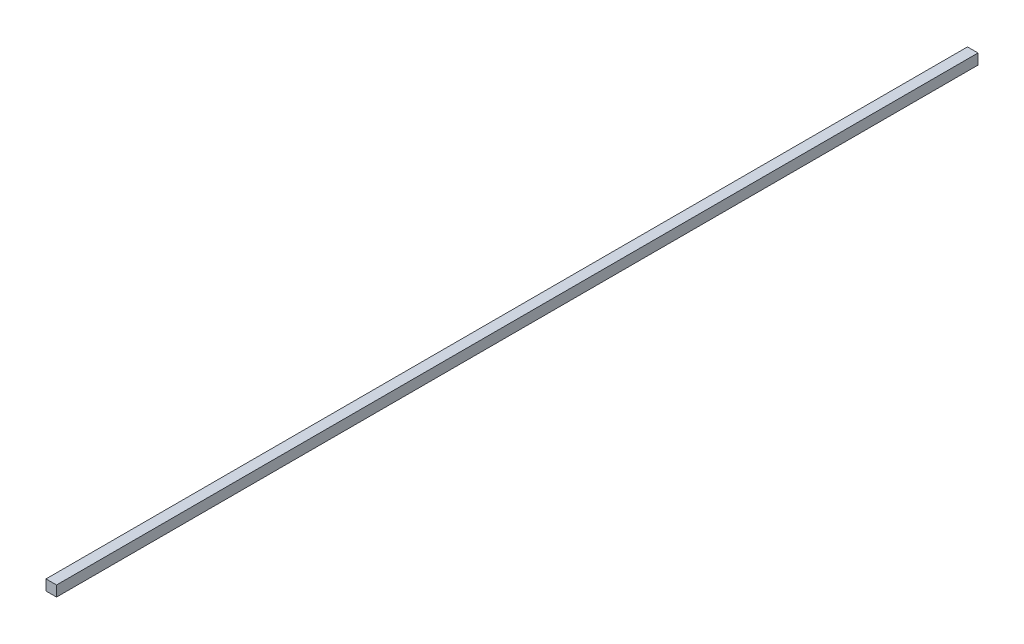
ISO-10303-21;
HEADER;
FILE_DESCRIPTION(('STEP AP214'),'2;1');
FILE_NAME('part.step','',(''),(''),'','','');
FILE_SCHEMA(('AUTOMOTIVE_DESIGN { 1 0 10303 214 1 1 1 1 }'));
ENDSEC;
DATA;
#1=APPLICATION_CONTEXT('core data for automotive mechanical design processes');
#2=APPLICATION_PROTOCOL_DEFINITION('international standard','automotive_design',2000,#1);
#3=PRODUCT_CONTEXT('',#1,'mechanical');
#4=PRODUCT('Part','Part','',(#3));
#5=PRODUCT_RELATED_PRODUCT_CATEGORY('part','',(#4));
#6=PRODUCT_DEFINITION_FORMATION('','',#4);
#7=PRODUCT_DEFINITION_CONTEXT('part definition',#1,'design');
#8=PRODUCT_DEFINITION('design','',#6,#7);
#9=PRODUCT_DEFINITION_SHAPE('','',#8);
#10=(LENGTH_UNIT() NAMED_UNIT(*) SI_UNIT(.MILLI.,.METRE.));
#11=(NAMED_UNIT(*) PLANE_ANGLE_UNIT() SI_UNIT($,.RADIAN.));
#12=(NAMED_UNIT(*) SI_UNIT($,.STERADIAN.) SOLID_ANGLE_UNIT());
#13=UNCERTAINTY_MEASURE_WITH_UNIT(LENGTH_MEASURE(1.E-05),#10,'distance_accuracy_value','');
#14=(GEOMETRIC_REPRESENTATION_CONTEXT(3) GLOBAL_UNCERTAINTY_ASSIGNED_CONTEXT((#13)) GLOBAL_UNIT_ASSIGNED_CONTEXT((#10,
#11,#12)) REPRESENTATION_CONTEXT('',''));
#15=CARTESIAN_POINT('',(0.,0.,0.));
#16=DIRECTION('',(0.,0.,1.));
#17=DIRECTION('',(1.,0.,0.));
#18=AXIS2_PLACEMENT_3D('',#15,#16,#17);
#19=CARTESIAN_POINT('',(-2.,-2.,175.));
#20=DIRECTION('',(1.,0.,0.));
#21=DIRECTION('',(0.,0.,-1.));
#22=AXIS2_PLACEMENT_3D('',#19,#20,#21);
#23=PLANE('',#22);
#24=DIRECTION('',(0.,0.,-1.));
#25=VECTOR('',#24,1.);
#26=CARTESIAN_POINT('',(-2.,2.,175.));
#27=LINE('',#26,#25);
#28=CARTESIAN_POINT('',(-2.,2.,175.));
#29=VERTEX_POINT('',#28);
#30=CARTESIAN_POINT('',(-2.,2.,-175.));
#31=VERTEX_POINT('',#30);
#32=EDGE_CURVE('E94',#29,#31,#27,.T.);
#33=ORIENTED_EDGE('',*,*,#32,.T.);
#34=DIRECTION('',(0.,-1.,0.));
#35=VECTOR('',#34,1.);
#36=CARTESIAN_POINT('',(-2.,-2.,-175.));
#37=LINE('',#36,#35);
#38=CARTESIAN_POINT('',(-2.,-2.,-175.));
#39=VERTEX_POINT('',#38);
#40=EDGE_CURVE('E89',#31,#39,#37,.T.);
#41=ORIENTED_EDGE('',*,*,#40,.T.);
#42=DIRECTION('',(0.,0.,-1.));
#43=VECTOR('',#42,1.);
#44=CARTESIAN_POINT('',(-2.,-2.,175.));
#45=LINE('',#44,#43);
#46=CARTESIAN_POINT('',(-2.,-2.,175.));
#47=VERTEX_POINT('',#46);
#48=EDGE_CURVE('E11',#47,#39,#45,.T.);
#49=ORIENTED_EDGE('',*,*,#48,.F.);
#50=DIRECTION('',(0.,-1.,0.));
#51=VECTOR('',#50,1.);
#52=CARTESIAN_POINT('',(-2.,-2.,175.));
#53=LINE('',#52,#51);
#54=EDGE_CURVE('E100',#29,#47,#53,.T.);
#55=ORIENTED_EDGE('',*,*,#54,.F.);
#56=EDGE_LOOP('',(#33,#41,#49,#55));
#57=FACE_BOUND('',#56,.T.);
#58=ADVANCED_FACE('F37',(#57),#23,.F.);
#59=CARTESIAN_POINT('',(2.,-2.,175.));
#60=DIRECTION('',(0.,1.,0.));
#61=DIRECTION('',(0.,0.,1.));
#62=AXIS2_PLACEMENT_3D('',#59,#60,#61);
#63=PLANE('',#62);
#64=ORIENTED_EDGE('',*,*,#48,.T.);
#65=DIRECTION('',(1.,0.,0.));
#66=VECTOR('',#65,1.);
#67=CARTESIAN_POINT('',(2.,-2.,-175.));
#68=LINE('',#67,#66);
#69=CARTESIAN_POINT('',(2.,-2.,-175.));
#70=VERTEX_POINT('',#69);
#71=EDGE_CURVE('E79',#39,#70,#68,.T.);
#72=ORIENTED_EDGE('',*,*,#71,.T.);
#73=DIRECTION('',(0.,0.,-1.));
#74=VECTOR('',#73,1.);
#75=CARTESIAN_POINT('',(2.,-2.,175.));
#76=LINE('',#75,#74);
#77=CARTESIAN_POINT('',(2.,-2.,175.));
#78=VERTEX_POINT('',#77);
#79=EDGE_CURVE('E44',#78,#70,#76,.T.);
#80=ORIENTED_EDGE('',*,*,#79,.F.);
#81=DIRECTION('',(1.,0.,0.));
#82=VECTOR('',#81,1.);
#83=CARTESIAN_POINT('',(2.,-2.,175.));
#84=LINE('',#83,#82);
#85=EDGE_CURVE('E80',#47,#78,#84,.T.);
#86=ORIENTED_EDGE('',*,*,#85,.F.);
#87=EDGE_LOOP('',(#64,#72,#80,#86));
#88=FACE_BOUND('',#87,.T.);
#89=ADVANCED_FACE('F77',(#88),#63,.F.);
#90=CARTESIAN_POINT('',(2.,2.,175.));
#91=DIRECTION('',(-1.,0.,0.));
#92=DIRECTION('',(0.,0.,1.));
#93=AXIS2_PLACEMENT_3D('',#90,#91,#92);
#94=PLANE('',#93);
#95=ORIENTED_EDGE('',*,*,#79,.T.);
#96=DIRECTION('',(0.,1.,0.));
#97=VECTOR('',#96,1.);
#98=CARTESIAN_POINT('',(2.,2.,-175.));
#99=LINE('',#98,#97);
#100=CARTESIAN_POINT('',(2.,2.,-175.));
#101=VERTEX_POINT('',#100);
#102=EDGE_CURVE('E92',#70,#101,#99,.T.);
#103=ORIENTED_EDGE('',*,*,#102,.T.);
#104=DIRECTION('',(0.,0.,-1.));
#105=VECTOR('',#104,1.);
#106=CARTESIAN_POINT('',(2.,2.,175.));
#107=LINE('',#106,#105);
#108=CARTESIAN_POINT('',(2.,2.,175.));
#109=VERTEX_POINT('',#108);
#110=EDGE_CURVE('E106',#109,#101,#107,.T.);
#111=ORIENTED_EDGE('',*,*,#110,.F.);
#112=DIRECTION('',(0.,1.,0.));
#113=VECTOR('',#112,1.);
#114=CARTESIAN_POINT('',(2.,2.,175.));
#115=LINE('',#114,#113);
#116=EDGE_CURVE('E56',#78,#109,#115,.T.);
#117=ORIENTED_EDGE('',*,*,#116,.F.);
#118=EDGE_LOOP('',(#95,#103,#111,#117));
#119=FACE_BOUND('',#118,.T.);
#120=ADVANCED_FACE('F108',(#119),#94,.F.);
#121=CARTESIAN_POINT('',(-2.,2.,175.));
#122=DIRECTION('',(0.,-1.,0.));
#123=DIRECTION('',(0.,0.,-1.));
#124=AXIS2_PLACEMENT_3D('',#121,#122,#123);
#125=PLANE('',#124);
#126=ORIENTED_EDGE('',*,*,#110,.T.);
#127=DIRECTION('',(-1.,0.,0.));
#128=VECTOR('',#127,1.);
#129=CARTESIAN_POINT('',(-2.,2.,-175.));
#130=LINE('',#129,#128);
#131=EDGE_CURVE('E98',#101,#31,#130,.T.);
#132=ORIENTED_EDGE('',*,*,#131,.T.);
#133=ORIENTED_EDGE('',*,*,#32,.F.);
#134=DIRECTION('',(-1.,0.,0.));
#135=VECTOR('',#134,1.);
#136=CARTESIAN_POINT('',(-2.,2.,175.));
#137=LINE('',#136,#135);
#138=EDGE_CURVE('E51',#109,#29,#137,.T.);
#139=ORIENTED_EDGE('',*,*,#138,.F.);
#140=EDGE_LOOP('',(#126,#132,#133,#139));
#141=FACE_BOUND('',#140,.T.);
#142=ADVANCED_FACE('F110',(#141),#125,.F.);
#143=CARTESIAN_POINT('',(0.,0.,175.));
#144=DIRECTION('',(0.,0.,-1.));
#145=DIRECTION('',(-1.,0.,0.));
#146=AXIS2_PLACEMENT_3D('',#143,#144,#145);
#147=PLANE('',#146);
#148=ORIENTED_EDGE('',*,*,#54,.T.);
#149=ORIENTED_EDGE('',*,*,#85,.T.);
#150=ORIENTED_EDGE('',*,*,#116,.T.);
#151=ORIENTED_EDGE('',*,*,#138,.T.);
#152=EDGE_LOOP('',(#148,#149,#150,#151));
#153=FACE_BOUND('',#152,.T.);
#154=ADVANCED_FACE('F111',(#153),#147,.F.);
#155=CARTESIAN_POINT('',(0.,0.,-175.));
#156=DIRECTION('',(0.,0.,-1.));
#157=DIRECTION('',(-1.,0.,0.));
#158=AXIS2_PLACEMENT_3D('',#155,#156,#157);
#159=PLANE('',#158);
#160=ORIENTED_EDGE('',*,*,#40,.F.);
#161=ORIENTED_EDGE('',*,*,#131,.F.);
#162=ORIENTED_EDGE('',*,*,#102,.F.);
#163=ORIENTED_EDGE('',*,*,#71,.F.);
#164=EDGE_LOOP('',(#160,#161,#162,#163));
#165=FACE_BOUND('',#164,.T.);
#166=ADVANCED_FACE('F87',(#165),#159,.T.);
#167=CLOSED_SHELL('',(#58,#89,#120,#142,#154,#166));
#168=MANIFOLD_SOLID_BREP('B2',#167);
#169=ADVANCED_BREP_SHAPE_REPRESENTATION('',(#18,#168),#14);
#170=SHAPE_DEFINITION_REPRESENTATION(#9,#169);
ENDSEC;
END-ISO-10303-21;
